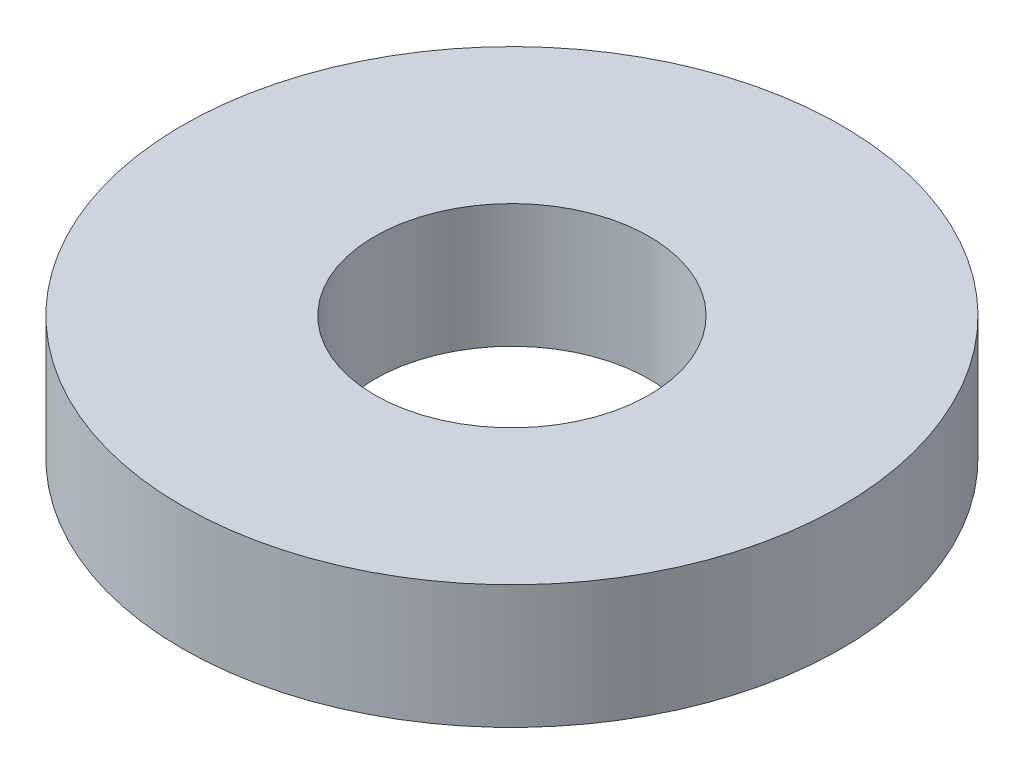
ISO-10303-21;
HEADER;
FILE_DESCRIPTION(('STEP AP214'),'2;1');
FILE_NAME('part.step','',(''),(''),'','','');
FILE_SCHEMA(('AUTOMOTIVE_DESIGN { 1 0 10303 214 1 1 1 1 }'));
ENDSEC;
DATA;
#1=APPLICATION_CONTEXT('core data for automotive mechanical design processes');
#2=APPLICATION_PROTOCOL_DEFINITION('international standard','automotive_design',2000,#1);
#3=PRODUCT_CONTEXT('',#1,'mechanical');
#4=PRODUCT('Part','Part','',(#3));
#5=PRODUCT_RELATED_PRODUCT_CATEGORY('part','',(#4));
#6=PRODUCT_DEFINITION_FORMATION('','',#4);
#7=PRODUCT_DEFINITION_CONTEXT('part definition',#1,'design');
#8=PRODUCT_DEFINITION('design','',#6,#7);
#9=PRODUCT_DEFINITION_SHAPE('','',#8);
#10=(LENGTH_UNIT() NAMED_UNIT(*) SI_UNIT(.MILLI.,.METRE.));
#11=(NAMED_UNIT(*) PLANE_ANGLE_UNIT() SI_UNIT($,.RADIAN.));
#12=(NAMED_UNIT(*) SI_UNIT($,.STERADIAN.) SOLID_ANGLE_UNIT());
#13=UNCERTAINTY_MEASURE_WITH_UNIT(LENGTH_MEASURE(1.E-05),#10,'distance_accuracy_value','');
#14=(GEOMETRIC_REPRESENTATION_CONTEXT(3) GLOBAL_UNCERTAINTY_ASSIGNED_CONTEXT((#13)) GLOBAL_UNIT_ASSIGNED_CONTEXT((#10,
#11,#12)) REPRESENTATION_CONTEXT('',''));
#15=CARTESIAN_POINT('',(0.,0.,0.));
#16=DIRECTION('',(0.,0.,1.));
#17=DIRECTION('',(1.,0.,0.));
#18=AXIS2_PLACEMENT_3D('',#15,#16,#17);
#19=CARTESIAN_POINT('',(0.,3.571875,0.));
#20=DIRECTION('',(0.,1.,0.));
#21=DIRECTION('',(0.,0.,1.));
#22=AXIS2_PLACEMENT_3D('',#19,#20,#21);
#23=PLANE('',#22);
#24=CARTESIAN_POINT('',(0.,3.571875,0.));
#25=DIRECTION('',(0.,1.,0.));
#26=DIRECTION('',(0.,0.,1.));
#27=AXIS2_PLACEMENT_3D('',#24,#25,#26);
#28=CIRCLE('',#27,9.525);
#29=CARTESIAN_POINT('',(0.,3.571875,9.525));
#30=VERTEX_POINT('',#29);
#31=EDGE_CURVE('E11',#30,#30,#28,.T.);
#32=ORIENTED_EDGE('',*,*,#31,.T.);
#33=EDGE_LOOP('',(#32));
#34=FACE_BOUND('',#33,.T.);
#35=CARTESIAN_POINT('',(0.,3.571875,0.));
#36=DIRECTION('',(0.,1.,0.));
#37=DIRECTION('',(0.,0.,1.));
#38=AXIS2_PLACEMENT_3D('',#35,#36,#37);
#39=CIRCLE('',#38,3.96875);
#40=CARTESIAN_POINT('',(0.,3.571875,3.96875));
#41=VERTEX_POINT('',#40);
#42=EDGE_CURVE('E370',#41,#41,#39,.T.);
#43=ORIENTED_EDGE('',*,*,#42,.F.);
#44=EDGE_LOOP('',(#43));
#45=FACE_BOUND('',#44,.T.);
#46=ADVANCED_FACE('F359',(#34,#45),#23,.T.);
#47=CARTESIAN_POINT('',(0.,0.,0.));
#48=DIRECTION('',(0.,1.,0.));
#49=DIRECTION('',(0.,0.,1.));
#50=AXIS2_PLACEMENT_3D('',#47,#48,#49);
#51=PLANE('',#50);
#52=CARTESIAN_POINT('',(0.,0.,0.));
#53=DIRECTION('',(0.,1.,0.));
#54=DIRECTION('',(0.,0.,1.));
#55=AXIS2_PLACEMENT_3D('',#52,#53,#54);
#56=CIRCLE('',#55,9.525);
#57=CARTESIAN_POINT('',(0.,0.,9.525));
#58=VERTEX_POINT('',#57);
#59=EDGE_CURVE('E366',#58,#58,#56,.T.);
#60=ORIENTED_EDGE('',*,*,#59,.F.);
#61=EDGE_LOOP('',(#60));
#62=FACE_BOUND('',#61,.T.);
#63=CARTESIAN_POINT('',(0.,0.,0.));
#64=DIRECTION('',(0.,1.,0.));
#65=DIRECTION('',(0.,0.,1.));
#66=AXIS2_PLACEMENT_3D('',#63,#64,#65);
#67=CIRCLE('',#66,3.96875);
#68=CARTESIAN_POINT('',(0.,0.,3.96875));
#69=VERTEX_POINT('',#68);
#70=EDGE_CURVE('E374',#69,#69,#67,.T.);
#71=ORIENTED_EDGE('',*,*,#70,.T.);
#72=EDGE_LOOP('',(#71));
#73=FACE_BOUND('',#72,.T.);
#74=ADVANCED_FACE('F380',(#62,#73),#51,.F.);
#75=CARTESIAN_POINT('',(0.,3.571875,0.));
#76=DIRECTION('',(0.,-1.,0.));
#77=DIRECTION('',(0.,0.,-1.));
#78=AXIS2_PLACEMENT_3D('',#75,#76,#77);
#79=CYLINDRICAL_SURFACE('',#78,9.525);
#80=ORIENTED_EDGE('',*,*,#31,.F.);
#81=EDGE_LOOP('',(#80));
#82=FACE_BOUND('',#81,.T.);
#83=ORIENTED_EDGE('',*,*,#59,.T.);
#84=EDGE_LOOP('',(#83));
#85=FACE_BOUND('',#84,.T.);
#86=ADVANCED_FACE('F361',(#82,#85),#79,.T.);
#87=CARTESIAN_POINT('',(0.,3.571875,0.));
#88=DIRECTION('',(0.,-1.,0.));
#89=DIRECTION('',(0.,0.,-1.));
#90=AXIS2_PLACEMENT_3D('',#87,#88,#89);
#91=CYLINDRICAL_SURFACE('',#90,3.96875);
#92=ORIENTED_EDGE('',*,*,#42,.T.);
#93=EDGE_LOOP('',(#92));
#94=FACE_BOUND('',#93,.T.);
#95=ORIENTED_EDGE('',*,*,#70,.F.);
#96=EDGE_LOOP('',(#95));
#97=FACE_BOUND('',#96,.T.);
#98=ADVANCED_FACE('F382',(#94,#97),#91,.F.);
#99=CLOSED_SHELL('',(#46,#74,#86,#98));
#100=MANIFOLD_SOLID_BREP('B2',#99);
#101=ADVANCED_BREP_SHAPE_REPRESENTATION('',(#18,#100),#14);
#102=SHAPE_DEFINITION_REPRESENTATION(#9,#101);
ENDSEC;
END-ISO-10303-21;
